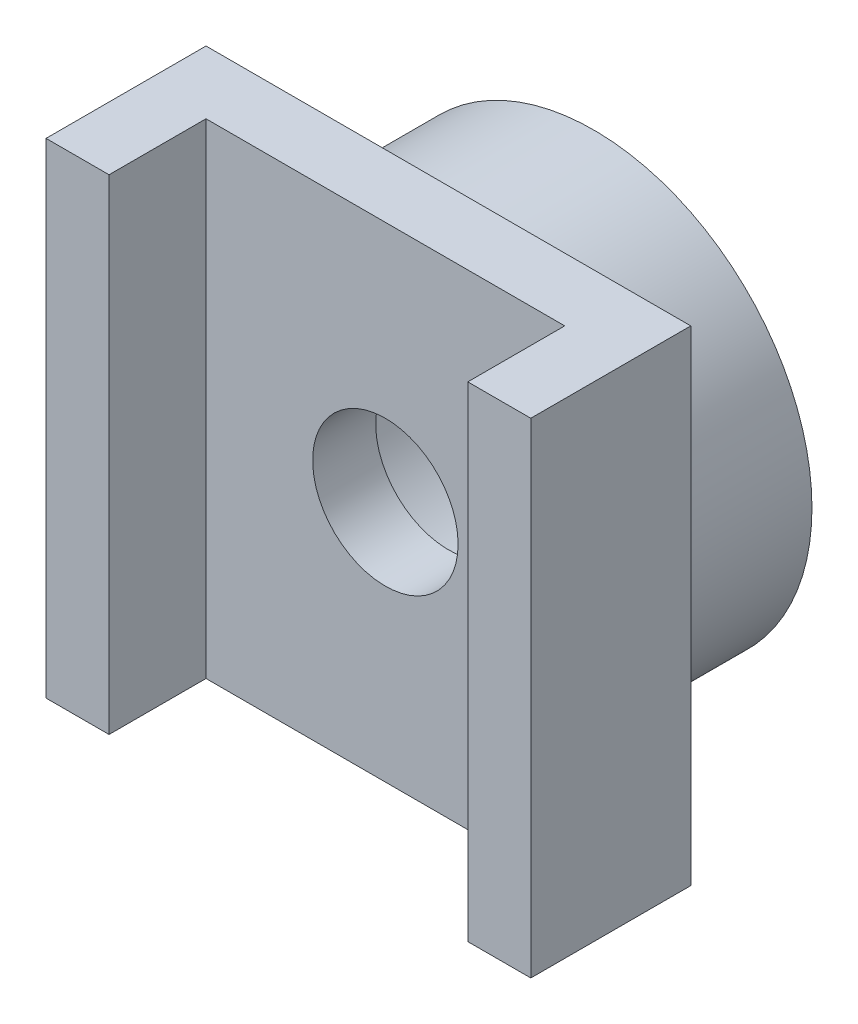
ISO-10303-21;
HEADER;
FILE_DESCRIPTION(('STEP AP214'),'2;1');
FILE_NAME('part.step','',(''),(''),'','','');
FILE_SCHEMA(('AUTOMOTIVE_DESIGN { 1 0 10303 214 1 1 1 1 }'));
ENDSEC;
DATA;
#1=APPLICATION_CONTEXT('core data for automotive mechanical design processes');
#2=APPLICATION_PROTOCOL_DEFINITION('international standard','automotive_design',2000,#1);
#3=PRODUCT_CONTEXT('',#1,'mechanical');
#4=PRODUCT('Part','Part','',(#3));
#5=PRODUCT_RELATED_PRODUCT_CATEGORY('part','',(#4));
#6=PRODUCT_DEFINITION_FORMATION('','',#4);
#7=PRODUCT_DEFINITION_CONTEXT('part definition',#1,'design');
#8=PRODUCT_DEFINITION('design','',#6,#7);
#9=PRODUCT_DEFINITION_SHAPE('','',#8);
#10=(LENGTH_UNIT() NAMED_UNIT(*) SI_UNIT(.MILLI.,.METRE.));
#11=(NAMED_UNIT(*) PLANE_ANGLE_UNIT() SI_UNIT($,.RADIAN.));
#12=(NAMED_UNIT(*) SI_UNIT($,.STERADIAN.) SOLID_ANGLE_UNIT());
#13=UNCERTAINTY_MEASURE_WITH_UNIT(LENGTH_MEASURE(1.E-05),#10,'distance_accuracy_value','');
#14=(GEOMETRIC_REPRESENTATION_CONTEXT(3) GLOBAL_UNCERTAINTY_ASSIGNED_CONTEXT((#13)) GLOBAL_UNIT_ASSIGNED_CONTEXT((#10,
#11,#12)) REPRESENTATION_CONTEXT('',''));
#15=CARTESIAN_POINT('',(0.,0.,0.));
#16=DIRECTION('',(0.,0.,1.));
#17=DIRECTION('',(1.,0.,0.));
#18=AXIS2_PLACEMENT_3D('',#15,#16,#17);
#19=CARTESIAN_POINT('',(0.,0.,4.3));
#20=DIRECTION('',(0.,0.,-1.));
#21=DIRECTION('',(-1.,0.,0.));
#22=AXIS2_PLACEMENT_3D('',#19,#20,#21);
#23=PLANE('',#22);
#24=CARTESIAN_POINT('',(0.,0.,4.3));
#25=DIRECTION('',(0.,0.,1.));
#26=DIRECTION('',(1.,0.,0.));
#27=AXIS2_PLACEMENT_3D('',#24,#25,#26);
#28=CIRCLE('',#27,1.5);
#29=CARTESIAN_POINT('',(1.5,0.,4.3));
#30=VERTEX_POINT('',#29);
#31=EDGE_CURVE('E148',#30,#30,#28,.T.);
#32=ORIENTED_EDGE('',*,*,#31,.F.);
#33=EDGE_LOOP('',(#32));
#34=FACE_BOUND('',#33,.T.);
#35=DIRECTION('',(0.,-1.,0.));
#36=VECTOR('',#35,1.);
#37=CARTESIAN_POINT('',(3.7,5.,4.3));
#38=LINE('',#37,#36);
#39=CARTESIAN_POINT('',(3.7,5.,4.3));
#40=VERTEX_POINT('',#39);
#41=CARTESIAN_POINT('',(3.7,-5.,4.3));
#42=VERTEX_POINT('',#41);
#43=EDGE_CURVE('E51',#40,#42,#38,.T.);
#44=ORIENTED_EDGE('',*,*,#43,.F.);
#45=DIRECTION('',(-1.,0.,0.));
#46=VECTOR('',#45,1.);
#47=CARTESIAN_POINT('',(-5.,5.,4.3));
#48=LINE('',#47,#46);
#49=CARTESIAN_POINT('',(-3.7,5.,4.3));
#50=VERTEX_POINT('',#49);
#51=EDGE_CURVE('E37',#40,#50,#48,.T.);
#52=ORIENTED_EDGE('',*,*,#51,.T.);
#53=DIRECTION('',(0.,1.,0.));
#54=VECTOR('',#53,1.);
#55=CARTESIAN_POINT('',(-3.7,5.,4.3));
#56=LINE('',#55,#54);
#57=CARTESIAN_POINT('',(-3.7,-5.,4.3));
#58=VERTEX_POINT('',#57);
#59=EDGE_CURVE('E134',#58,#50,#56,.T.);
#60=ORIENTED_EDGE('',*,*,#59,.F.);
#61=DIRECTION('',(1.,0.,0.));
#62=VECTOR('',#61,1.);
#63=CARTESIAN_POINT('',(-5.,-5.,4.3));
#64=LINE('',#63,#62);
#65=EDGE_CURVE('E56',#58,#42,#64,.T.);
#66=ORIENTED_EDGE('',*,*,#65,.T.);
#67=EDGE_LOOP('',(#44,#52,#60,#66));
#68=FACE_BOUND('',#67,.T.);
#69=ADVANCED_FACE('F33',(#34,#68),#23,.F.);
#70=CARTESIAN_POINT('',(0.,0.,0.));
#71=DIRECTION('',(0.,0.,1.));
#72=DIRECTION('',(1.,0.,0.));
#73=AXIS2_PLACEMENT_3D('',#70,#71,#72);
#74=PLANE('',#73);
#75=CARTESIAN_POINT('',(0.,0.,0.));
#76=DIRECTION('',(0.,0.,1.));
#77=DIRECTION('',(1.,0.,0.));
#78=AXIS2_PLACEMENT_3D('',#75,#76,#77);
#79=CIRCLE('',#78,4.5);
#80=CARTESIAN_POINT('',(4.5,0.,0.));
#81=VERTEX_POINT('',#80);
#82=EDGE_CURVE('E43',#81,#81,#79,.T.);
#83=ORIENTED_EDGE('',*,*,#82,.F.);
#84=EDGE_LOOP('',(#83));
#85=FACE_BOUND('',#84,.T.);
#86=CARTESIAN_POINT('',(0.,0.,0.));
#87=DIRECTION('',(0.,0.,1.));
#88=DIRECTION('',(1.,0.,0.));
#89=AXIS2_PLACEMENT_3D('',#86,#87,#88);
#90=CIRCLE('',#89,2.8);
#91=CARTESIAN_POINT('',(2.8,0.,0.));
#92=VERTEX_POINT('',#91);
#93=EDGE_CURVE('E190',#92,#92,#90,.T.);
#94=ORIENTED_EDGE('',*,*,#93,.T.);
#95=EDGE_LOOP('',(#94));
#96=FACE_BOUND('',#95,.T.);
#97=ADVANCED_FACE('F196',(#85,#96),#74,.F.);
#98=CARTESIAN_POINT('',(0.,0.,3.));
#99=DIRECTION('',(0.,0.,-1.));
#100=DIRECTION('',(-1.,0.,0.));
#101=AXIS2_PLACEMENT_3D('',#98,#99,#100);
#102=CYLINDRICAL_SURFACE('',#101,4.5);
#103=CARTESIAN_POINT('',(0.,0.,3.));
#104=DIRECTION('',(0.,0.,1.));
#105=DIRECTION('',(1.,0.,0.));
#106=AXIS2_PLACEMENT_3D('',#103,#104,#105);
#107=CIRCLE('',#106,4.5);
#108=CARTESIAN_POINT('',(4.5,0.,3.));
#109=VERTEX_POINT('',#108);
#110=EDGE_CURVE('E11',#109,#109,#107,.T.);
#111=ORIENTED_EDGE('',*,*,#110,.F.);
#112=EDGE_LOOP('',(#111));
#113=FACE_BOUND('',#112,.T.);
#114=ORIENTED_EDGE('',*,*,#82,.T.);
#115=EDGE_LOOP('',(#114));
#116=FACE_BOUND('',#115,.T.);
#117=ADVANCED_FACE('F35',(#113,#116),#102,.T.);
#118=CARTESIAN_POINT('',(0.,0.,3.));
#119=DIRECTION('',(0.,0.,-1.));
#120=DIRECTION('',(-1.,0.,0.));
#121=AXIS2_PLACEMENT_3D('',#118,#119,#120);
#122=CYLINDRICAL_SURFACE('',#121,2.8);
#123=CARTESIAN_POINT('',(0.,0.,3.));
#124=DIRECTION('',(0.,0.,-1.));
#125=DIRECTION('',(-1.,0.,0.));
#126=AXIS2_PLACEMENT_3D('',#123,#124,#125);
#127=CIRCLE('',#126,2.8);
#128=CARTESIAN_POINT('',(-2.8,0.,3.));
#129=VERTEX_POINT('',#128);
#130=EDGE_CURVE('E109',#129,#129,#127,.T.);
#131=ORIENTED_EDGE('',*,*,#130,.F.);
#132=EDGE_LOOP('',(#131));
#133=FACE_BOUND('',#132,.T.);
#134=ORIENTED_EDGE('',*,*,#93,.F.);
#135=EDGE_LOOP('',(#134));
#136=FACE_BOUND('',#135,.T.);
#137=ADVANCED_FACE('F201',(#133,#136),#122,.F.);
#138=CARTESIAN_POINT('',(0.,0.,3.));
#139=DIRECTION('',(0.,0.,-1.));
#140=DIRECTION('',(-1.,0.,0.));
#141=AXIS2_PLACEMENT_3D('',#138,#139,#140);
#142=PLANE('',#141);
#143=DIRECTION('',(0.,1.,0.));
#144=VECTOR('',#143,1.);
#145=CARTESIAN_POINT('',(5.,-5.,3.));
#146=LINE('',#145,#144);
#147=CARTESIAN_POINT('',(5.,-5.,3.));
#148=VERTEX_POINT('',#147);
#149=CARTESIAN_POINT('',(5.,5.,3.));
#150=VERTEX_POINT('',#149);
#151=EDGE_CURVE('E107',#148,#150,#146,.T.);
#152=ORIENTED_EDGE('',*,*,#151,.F.);
#153=DIRECTION('',(1.,0.,0.));
#154=VECTOR('',#153,1.);
#155=CARTESIAN_POINT('',(-5.,-5.,3.));
#156=LINE('',#155,#154);
#157=CARTESIAN_POINT('',(-5.,-5.,3.));
#158=VERTEX_POINT('',#157);
#159=EDGE_CURVE('E179',#158,#148,#156,.T.);
#160=ORIENTED_EDGE('',*,*,#159,.F.);
#161=DIRECTION('',(0.,-1.,0.));
#162=VECTOR('',#161,1.);
#163=CARTESIAN_POINT('',(-5.,-5.,3.));
#164=LINE('',#163,#162);
#165=CARTESIAN_POINT('',(-5.,5.,3.));
#166=VERTEX_POINT('',#165);
#167=EDGE_CURVE('E177',#166,#158,#164,.T.);
#168=ORIENTED_EDGE('',*,*,#167,.F.);
#169=DIRECTION('',(-1.,0.,0.));
#170=VECTOR('',#169,1.);
#171=CARTESIAN_POINT('',(-5.,5.,3.));
#172=LINE('',#171,#170);
#173=EDGE_CURVE('E175',#150,#166,#172,.T.);
#174=ORIENTED_EDGE('',*,*,#173,.F.);
#175=EDGE_LOOP('',(#152,#160,#168,#174));
#176=FACE_BOUND('',#175,.T.);
#177=ORIENTED_EDGE('',*,*,#110,.T.);
#178=EDGE_LOOP('',(#177));
#179=FACE_BOUND('',#178,.T.);
#180=ADVANCED_FACE('F203',(#176,#179),#142,.T.);
#181=ORIENTED_EDGE('',*,*,#130,.T.);
#182=EDGE_LOOP('',(#181));
#183=FACE_BOUND('',#182,.T.);
#184=CARTESIAN_POINT('',(0.,0.,3.));
#185=DIRECTION('',(0.,0.,1.));
#186=DIRECTION('',(1.,0.,0.));
#187=AXIS2_PLACEMENT_3D('',#184,#185,#186);
#188=CIRCLE('',#187,1.5);
#189=CARTESIAN_POINT('',(1.5,0.,3.));
#190=VERTEX_POINT('',#189);
#191=EDGE_CURVE('E162',#190,#190,#188,.T.);
#192=ORIENTED_EDGE('',*,*,#191,.T.);
#193=EDGE_LOOP('',(#192));
#194=FACE_BOUND('',#193,.T.);
#195=ADVANCED_FACE('F210',(#183,#194),#142,.T.);
#196=CARTESIAN_POINT('',(5.,-5.,4.3));
#197=DIRECTION('',(-1.,0.,0.));
#198=DIRECTION('',(0.,0.,1.));
#199=AXIS2_PLACEMENT_3D('',#196,#197,#198);
#200=PLANE('',#199);
#201=ORIENTED_EDGE('',*,*,#151,.T.);
#202=DIRECTION('',(0.,0.,-1.));
#203=VECTOR('',#202,1.);
#204=CARTESIAN_POINT('',(5.,5.,4.3));
#205=LINE('',#204,#203);
#206=CARTESIAN_POINT('',(5.,5.,6.3));
#207=VERTEX_POINT('',#206);
#208=EDGE_CURVE('E100',#207,#150,#205,.T.);
#209=ORIENTED_EDGE('',*,*,#208,.F.);
#210=DIRECTION('',(0.,1.,0.));
#211=VECTOR('',#210,1.);
#212=CARTESIAN_POINT('',(5.,5.,6.3));
#213=LINE('',#212,#211);
#214=CARTESIAN_POINT('',(5.,-5.,6.3));
#215=VERTEX_POINT('',#214);
#216=EDGE_CURVE('E105',#215,#207,#213,.T.);
#217=ORIENTED_EDGE('',*,*,#216,.F.);
#218=DIRECTION('',(0.,0.,-1.));
#219=VECTOR('',#218,1.);
#220=CARTESIAN_POINT('',(5.,-5.,4.3));
#221=LINE('',#220,#219);
#222=EDGE_CURVE('E181',#215,#148,#221,.T.);
#223=ORIENTED_EDGE('',*,*,#222,.T.);
#224=EDGE_LOOP('',(#201,#209,#217,#223));
#225=FACE_BOUND('',#224,.T.);
#226=ADVANCED_FACE('F102',(#225),#200,.F.);
#227=CARTESIAN_POINT('',(-5.,5.,4.3));
#228=DIRECTION('',(0.,-1.,0.));
#229=DIRECTION('',(0.,0.,-1.));
#230=AXIS2_PLACEMENT_3D('',#227,#228,#229);
#231=PLANE('',#230);
#232=ORIENTED_EDGE('',*,*,#173,.T.);
#233=DIRECTION('',(0.,0.,-1.));
#234=VECTOR('',#233,1.);
#235=CARTESIAN_POINT('',(-5.,5.,4.3));
#236=LINE('',#235,#234);
#237=CARTESIAN_POINT('',(-5.,5.,6.3));
#238=VERTEX_POINT('',#237);
#239=EDGE_CURVE('E110',#238,#166,#236,.T.);
#240=ORIENTED_EDGE('',*,*,#239,.F.);
#241=DIRECTION('',(-1.,0.,0.));
#242=VECTOR('',#241,1.);
#243=CARTESIAN_POINT('',(-5.,5.,6.3));
#244=LINE('',#243,#242);
#245=CARTESIAN_POINT('',(-3.7,5.,6.3));
#246=VERTEX_POINT('',#245);
#247=EDGE_CURVE('E142',#246,#238,#244,.T.);
#248=ORIENTED_EDGE('',*,*,#247,.F.);
#249=DIRECTION('',(0.,0.,-1.));
#250=VECTOR('',#249,1.);
#251=CARTESIAN_POINT('',(-3.7,5.,6.3));
#252=LINE('',#251,#250);
#253=EDGE_CURVE('E145',#246,#50,#252,.T.);
#254=ORIENTED_EDGE('',*,*,#253,.T.);
#255=ORIENTED_EDGE('',*,*,#51,.F.);
#256=DIRECTION('',(0.,0.,-1.));
#257=VECTOR('',#256,1.);
#258=CARTESIAN_POINT('',(3.7,5.,6.3));
#259=LINE('',#258,#257);
#260=CARTESIAN_POINT('',(3.7,5.,6.3));
#261=VERTEX_POINT('',#260);
#262=EDGE_CURVE('E116',#261,#40,#259,.T.);
#263=ORIENTED_EDGE('',*,*,#262,.F.);
#264=DIRECTION('',(-1.,0.,0.));
#265=VECTOR('',#264,1.);
#266=CARTESIAN_POINT('',(5.,5.,6.3));
#267=LINE('',#266,#265);
#268=EDGE_CURVE('E113',#207,#261,#267,.T.);
#269=ORIENTED_EDGE('',*,*,#268,.F.);
#270=ORIENTED_EDGE('',*,*,#208,.T.);
#271=EDGE_LOOP('',(#232,#240,#248,#254,#255,#263,#269,#270));
#272=FACE_BOUND('',#271,.T.);
#273=ADVANCED_FACE('F114',(#272),#231,.F.);
#274=CARTESIAN_POINT('',(-5.,-5.,4.3));
#275=DIRECTION('',(1.,0.,0.));
#276=DIRECTION('',(0.,0.,-1.));
#277=AXIS2_PLACEMENT_3D('',#274,#275,#276);
#278=PLANE('',#277);
#279=ORIENTED_EDGE('',*,*,#167,.T.);
#280=DIRECTION('',(0.,0.,-1.));
#281=VECTOR('',#280,1.);
#282=CARTESIAN_POINT('',(-5.,-5.,4.3));
#283=LINE('',#282,#281);
#284=CARTESIAN_POINT('',(-5.,-5.,6.3));
#285=VERTEX_POINT('',#284);
#286=EDGE_CURVE('E183',#285,#158,#283,.T.);
#287=ORIENTED_EDGE('',*,*,#286,.F.);
#288=DIRECTION('',(0.,-1.,0.));
#289=VECTOR('',#288,1.);
#290=CARTESIAN_POINT('',(-5.,5.,6.3));
#291=LINE('',#290,#289);
#292=EDGE_CURVE('E135',#238,#285,#291,.T.);
#293=ORIENTED_EDGE('',*,*,#292,.F.);
#294=ORIENTED_EDGE('',*,*,#239,.T.);
#295=EDGE_LOOP('',(#279,#287,#293,#294));
#296=FACE_BOUND('',#295,.T.);
#297=ADVANCED_FACE('F231',(#296),#278,.F.);
#298=CARTESIAN_POINT('',(-5.,-5.,4.3));
#299=DIRECTION('',(0.,1.,0.));
#300=DIRECTION('',(0.,0.,1.));
#301=AXIS2_PLACEMENT_3D('',#298,#299,#300);
#302=PLANE('',#301);
#303=ORIENTED_EDGE('',*,*,#159,.T.);
#304=ORIENTED_EDGE('',*,*,#222,.F.);
#305=DIRECTION('',(1.,0.,0.));
#306=VECTOR('',#305,1.);
#307=CARTESIAN_POINT('',(5.,-5.,6.3));
#308=LINE('',#307,#306);
#309=CARTESIAN_POINT('',(3.7,-5.,6.3));
#310=VERTEX_POINT('',#309);
#311=EDGE_CURVE('E124',#310,#215,#308,.T.);
#312=ORIENTED_EDGE('',*,*,#311,.F.);
#313=DIRECTION('',(0.,0.,-1.));
#314=VECTOR('',#313,1.);
#315=CARTESIAN_POINT('',(3.7,-5.,6.3));
#316=LINE('',#315,#314);
#317=EDGE_CURVE('E129',#310,#42,#316,.T.);
#318=ORIENTED_EDGE('',*,*,#317,.T.);
#319=ORIENTED_EDGE('',*,*,#65,.F.);
#320=DIRECTION('',(0.,0.,-1.));
#321=VECTOR('',#320,1.);
#322=CARTESIAN_POINT('',(-3.7,-5.,6.3));
#323=LINE('',#322,#321);
#324=CARTESIAN_POINT('',(-3.7,-5.,6.3));
#325=VERTEX_POINT('',#324);
#326=EDGE_CURVE('E158',#325,#58,#323,.T.);
#327=ORIENTED_EDGE('',*,*,#326,.F.);
#328=DIRECTION('',(1.,0.,0.));
#329=VECTOR('',#328,1.);
#330=CARTESIAN_POINT('',(-5.,-5.,6.3));
#331=LINE('',#330,#329);
#332=EDGE_CURVE('E138',#285,#325,#331,.T.);
#333=ORIENTED_EDGE('',*,*,#332,.F.);
#334=ORIENTED_EDGE('',*,*,#286,.T.);
#335=EDGE_LOOP('',(#303,#304,#312,#318,#319,#327,#333,#334));
#336=FACE_BOUND('',#335,.T.);
#337=ADVANCED_FACE('F228',(#336),#302,.F.);
#338=CARTESIAN_POINT('',(0.,0.,4.3));
#339=DIRECTION('',(0.,0.,-1.));
#340=DIRECTION('',(-1.,0.,0.));
#341=AXIS2_PLACEMENT_3D('',#338,#339,#340);
#342=CYLINDRICAL_SURFACE('',#341,1.5);
#343=ORIENTED_EDGE('',*,*,#31,.T.);
#344=EDGE_LOOP('',(#343));
#345=FACE_BOUND('',#344,.T.);
#346=ORIENTED_EDGE('',*,*,#191,.F.);
#347=EDGE_LOOP('',(#346));
#348=FACE_BOUND('',#347,.T.);
#349=ADVANCED_FACE('F223',(#345,#348),#342,.F.);
#350=CARTESIAN_POINT('',(-3.7,5.,6.3));
#351=DIRECTION('',(-1.,0.,0.));
#352=DIRECTION('',(0.,-1.,0.));
#353=AXIS2_PLACEMENT_3D('',#350,#351,#352);
#354=PLANE('',#353);
#355=ORIENTED_EDGE('',*,*,#59,.T.);
#356=ORIENTED_EDGE('',*,*,#253,.F.);
#357=DIRECTION('',(0.,1.,0.));
#358=VECTOR('',#357,1.);
#359=CARTESIAN_POINT('',(-3.7,5.,6.3));
#360=LINE('',#359,#358);
#361=EDGE_CURVE('E140',#325,#246,#360,.T.);
#362=ORIENTED_EDGE('',*,*,#361,.F.);
#363=ORIENTED_EDGE('',*,*,#326,.T.);
#364=EDGE_LOOP('',(#355,#356,#362,#363));
#365=FACE_BOUND('',#364,.T.);
#366=ADVANCED_FACE('F261',(#365),#354,.F.);
#367=CARTESIAN_POINT('',(0.,0.,6.3));
#368=DIRECTION('',(0.,0.,1.));
#369=DIRECTION('',(1.,0.,0.));
#370=AXIS2_PLACEMENT_3D('',#367,#368,#369);
#371=PLANE('',#370);
#372=ORIENTED_EDGE('',*,*,#292,.T.);
#373=ORIENTED_EDGE('',*,*,#332,.T.);
#374=ORIENTED_EDGE('',*,*,#361,.T.);
#375=ORIENTED_EDGE('',*,*,#247,.T.);
#376=EDGE_LOOP('',(#372,#373,#374,#375));
#377=FACE_BOUND('',#376,.T.);
#378=ADVANCED_FACE('F267',(#377),#371,.T.);
#379=CARTESIAN_POINT('',(3.7,5.,6.3));
#380=DIRECTION('',(1.,0.,0.));
#381=DIRECTION('',(0.,1.,0.));
#382=AXIS2_PLACEMENT_3D('',#379,#380,#381);
#383=PLANE('',#382);
#384=ORIENTED_EDGE('',*,*,#43,.T.);
#385=ORIENTED_EDGE('',*,*,#317,.F.);
#386=DIRECTION('',(0.,-1.,0.));
#387=VECTOR('',#386,1.);
#388=CARTESIAN_POINT('',(3.7,5.,6.3));
#389=LINE('',#388,#387);
#390=EDGE_CURVE('E119',#261,#310,#389,.T.);
#391=ORIENTED_EDGE('',*,*,#390,.F.);
#392=ORIENTED_EDGE('',*,*,#262,.T.);
#393=EDGE_LOOP('',(#384,#385,#391,#392));
#394=FACE_BOUND('',#393,.T.);
#395=ADVANCED_FACE('F273',(#394),#383,.F.);
#396=CARTESIAN_POINT('',(0.,0.,6.3));
#397=DIRECTION('',(0.,0.,-1.));
#398=DIRECTION('',(-1.,0.,0.));
#399=AXIS2_PLACEMENT_3D('',#396,#397,#398);
#400=PLANE('',#399);
#401=ORIENTED_EDGE('',*,*,#216,.T.);
#402=ORIENTED_EDGE('',*,*,#268,.T.);
#403=ORIENTED_EDGE('',*,*,#390,.T.);
#404=ORIENTED_EDGE('',*,*,#311,.T.);
#405=EDGE_LOOP('',(#401,#402,#403,#404));
#406=FACE_BOUND('',#405,.T.);
#407=ADVANCED_FACE('F122',(#406),#400,.F.);
#408=CLOSED_SHELL('',(#69,#97,#117,#137,#180,#195,#226,#273,#297,#337,#349,#366,#378,#395,#407));
#409=MANIFOLD_SOLID_BREP('B2',#408);
#410=ADVANCED_BREP_SHAPE_REPRESENTATION('',(#18,#409),#14);
#411=SHAPE_DEFINITION_REPRESENTATION(#9,#410);
ENDSEC;
END-ISO-10303-21;
